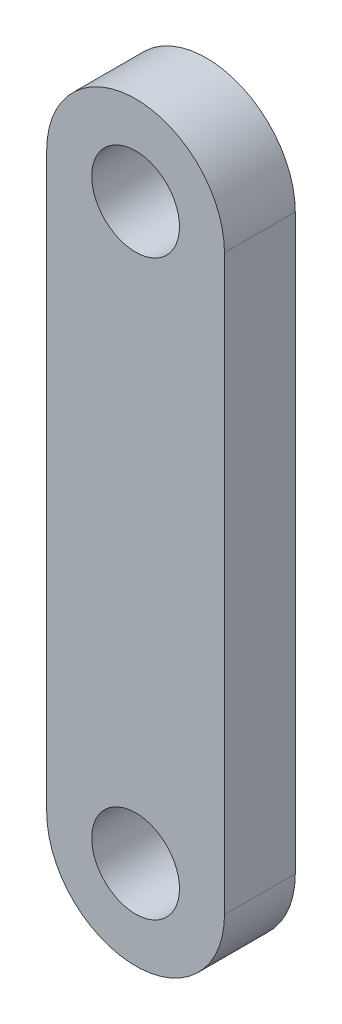
ISO-10303-21;
HEADER;
FILE_DESCRIPTION(('STEP AP214'),'2;1');
FILE_NAME('part.step','',(''),(''),'','','');
FILE_SCHEMA(('AUTOMOTIVE_DESIGN { 1 0 10303 214 1 1 1 1 }'));
ENDSEC;
DATA;
#1=APPLICATION_CONTEXT('core data for automotive mechanical design processes');
#2=APPLICATION_PROTOCOL_DEFINITION('international standard','automotive_design',2000,#1);
#3=PRODUCT_CONTEXT('',#1,'mechanical');
#4=PRODUCT('Part','Part','',(#3));
#5=PRODUCT_RELATED_PRODUCT_CATEGORY('part','',(#4));
#6=PRODUCT_DEFINITION_FORMATION('','',#4);
#7=PRODUCT_DEFINITION_CONTEXT('part definition',#1,'design');
#8=PRODUCT_DEFINITION('design','',#6,#7);
#9=PRODUCT_DEFINITION_SHAPE('','',#8);
#10=(LENGTH_UNIT() NAMED_UNIT(*) SI_UNIT(.MILLI.,.METRE.));
#11=(NAMED_UNIT(*) PLANE_ANGLE_UNIT() SI_UNIT($,.RADIAN.));
#12=(NAMED_UNIT(*) SI_UNIT($,.STERADIAN.) SOLID_ANGLE_UNIT());
#13=UNCERTAINTY_MEASURE_WITH_UNIT(LENGTH_MEASURE(1.E-05),#10,'distance_accuracy_value','');
#14=(GEOMETRIC_REPRESENTATION_CONTEXT(3) GLOBAL_UNCERTAINTY_ASSIGNED_CONTEXT((#13)) GLOBAL_UNIT_ASSIGNED_CONTEXT((#10,
#11,#12)) REPRESENTATION_CONTEXT('',''));
#15=CARTESIAN_POINT('',(0.,0.,0.));
#16=DIRECTION('',(0.,0.,1.));
#17=DIRECTION('',(1.,0.,0.));
#18=AXIS2_PLACEMENT_3D('',#15,#16,#17);
#19=CARTESIAN_POINT('',(0.,38.0750020317063,6.35));
#20=DIRECTION('',(0.,0.,1.));
#21=DIRECTION('',(1.,0.,0.));
#22=AXIS2_PLACEMENT_3D('',#19,#20,#21);
#23=PLANE('',#22);
#24=CARTESIAN_POINT('',(0.,38.0750020317063,6.35));
#25=DIRECTION('',(0.,0.,1.));
#26=DIRECTION('',(1.,0.,0.));
#27=AXIS2_PLACEMENT_3D('',#24,#25,#26);
#28=CIRCLE('',#27,3.937);
#29=CARTESIAN_POINT('',(3.937,38.0750020317063,6.35));
#30=VERTEX_POINT('',#29);
#31=EDGE_CURVE('E99',#30,#30,#28,.T.);
#32=ORIENTED_EDGE('',*,*,#31,.F.);
#33=EDGE_LOOP('',(#32));
#34=FACE_BOUND('',#33,.T.);
#35=CARTESIAN_POINT('',(0.,38.0750020317063,6.35));
#36=DIRECTION('',(0.,0.,1.));
#37=DIRECTION('',(1.,0.,0.));
#38=AXIS2_PLACEMENT_3D('',#35,#36,#37);
#39=CIRCLE('',#38,7.9756);
#40=CARTESIAN_POINT('',(7.9756,38.0750020317063,6.35));
#41=VERTEX_POINT('',#40);
#42=CARTESIAN_POINT('',(-7.9756,38.0750020317063,6.35));
#43=VERTEX_POINT('',#42);
#44=EDGE_CURVE('E84',#41,#43,#39,.T.);
#45=ORIENTED_EDGE('',*,*,#44,.T.);
#46=DIRECTION('',(0.,-1.,0.));
#47=VECTOR('',#46,1.);
#48=CARTESIAN_POINT('',(-7.9756,38.0750020317063,6.35));
#49=LINE('',#48,#47);
#50=CARTESIAN_POINT('',(-7.9756,-13.3599979682937,6.35));
#51=VERTEX_POINT('',#50);
#52=EDGE_CURVE('E79',#43,#51,#49,.T.);
#53=ORIENTED_EDGE('',*,*,#52,.T.);
#54=CARTESIAN_POINT('',(0.,-13.3599979682937,6.35));
#55=DIRECTION('',(0.,0.,1.));
#56=DIRECTION('',(1.,0.,0.));
#57=AXIS2_PLACEMENT_3D('',#54,#55,#56);
#58=CIRCLE('',#57,7.9756);
#59=CARTESIAN_POINT('',(7.97560000000001,-13.3599979682937,6.35));
#60=VERTEX_POINT('',#59);
#61=EDGE_CURVE('E82',#51,#60,#58,.T.);
#62=ORIENTED_EDGE('',*,*,#61,.T.);
#63=DIRECTION('',(0.,1.,0.));
#64=VECTOR('',#63,1.);
#65=CARTESIAN_POINT('',(7.9756,38.0750020317063,6.35));
#66=LINE('',#65,#64);
#67=EDGE_CURVE('E49',#60,#41,#66,.T.);
#68=ORIENTED_EDGE('',*,*,#67,.T.);
#69=EDGE_LOOP('',(#45,#53,#62,#68));
#70=FACE_BOUND('',#69,.T.);
#71=CARTESIAN_POINT('',(0.,-13.3599979682937,6.35));
#72=DIRECTION('',(0.,0.,1.));
#73=DIRECTION('',(1.,0.,0.));
#74=AXIS2_PLACEMENT_3D('',#71,#72,#73);
#75=CIRCLE('',#74,3.937);
#76=CARTESIAN_POINT('',(3.937,-13.3599979682937,6.35));
#77=VERTEX_POINT('',#76);
#78=EDGE_CURVE('E114',#77,#77,#75,.T.);
#79=ORIENTED_EDGE('',*,*,#78,.F.);
#80=EDGE_LOOP('',(#79));
#81=FACE_BOUND('',#80,.T.);
#82=ADVANCED_FACE('F32',(#34,#70,#81),#23,.T.);
#83=CARTESIAN_POINT('',(0.,38.0750020317063,0.));
#84=DIRECTION('',(0.,0.,1.));
#85=DIRECTION('',(1.,0.,0.));
#86=AXIS2_PLACEMENT_3D('',#83,#84,#85);
#87=PLANE('',#86);
#88=CARTESIAN_POINT('',(0.,38.0750020317063,0.));
#89=DIRECTION('',(0.,0.,1.));
#90=DIRECTION('',(1.,0.,0.));
#91=AXIS2_PLACEMENT_3D('',#88,#89,#90);
#92=CIRCLE('',#91,7.9756);
#93=CARTESIAN_POINT('',(7.9756,38.0750020317063,0.));
#94=VERTEX_POINT('',#93);
#95=CARTESIAN_POINT('',(-7.9756,38.0750020317063,0.));
#96=VERTEX_POINT('',#95);
#97=EDGE_CURVE('E96',#94,#96,#92,.T.);
#98=ORIENTED_EDGE('',*,*,#97,.F.);
#99=DIRECTION('',(0.,1.,0.));
#100=VECTOR('',#99,1.);
#101=CARTESIAN_POINT('',(7.9756,38.0750020317063,0.));
#102=LINE('',#101,#100);
#103=CARTESIAN_POINT('',(7.97560000000001,-13.3599979682937,0.));
#104=VERTEX_POINT('',#103);
#105=EDGE_CURVE('E72',#104,#94,#102,.T.);
#106=ORIENTED_EDGE('',*,*,#105,.F.);
#107=CARTESIAN_POINT('',(0.,-13.3599979682937,0.));
#108=DIRECTION('',(0.,0.,1.));
#109=DIRECTION('',(1.,0.,0.));
#110=AXIS2_PLACEMENT_3D('',#107,#108,#109);
#111=CIRCLE('',#110,7.9756);
#112=CARTESIAN_POINT('',(-7.9756,-13.3599979682937,0.));
#113=VERTEX_POINT('',#112);
#114=EDGE_CURVE('E66',#113,#104,#111,.T.);
#115=ORIENTED_EDGE('',*,*,#114,.F.);
#116=DIRECTION('',(0.,-1.,0.));
#117=VECTOR('',#116,1.);
#118=CARTESIAN_POINT('',(-7.9756,38.0750020317063,0.));
#119=LINE('',#118,#117);
#120=EDGE_CURVE('E88',#96,#113,#119,.T.);
#121=ORIENTED_EDGE('',*,*,#120,.F.);
#122=EDGE_LOOP('',(#98,#106,#115,#121));
#123=FACE_BOUND('',#122,.T.);
#124=CARTESIAN_POINT('',(0.,38.0750020317063,0.));
#125=DIRECTION('',(0.,0.,1.));
#126=DIRECTION('',(1.,0.,0.));
#127=AXIS2_PLACEMENT_3D('',#124,#125,#126);
#128=CIRCLE('',#127,3.937);
#129=CARTESIAN_POINT('',(3.937,38.0750020317063,0.));
#130=VERTEX_POINT('',#129);
#131=EDGE_CURVE('E111',#130,#130,#128,.T.);
#132=ORIENTED_EDGE('',*,*,#131,.T.);
#133=EDGE_LOOP('',(#132));
#134=FACE_BOUND('',#133,.T.);
#135=CARTESIAN_POINT('',(0.,-13.3599979682937,0.));
#136=DIRECTION('',(0.,0.,1.));
#137=DIRECTION('',(1.,0.,0.));
#138=AXIS2_PLACEMENT_3D('',#135,#136,#137);
#139=CIRCLE('',#138,3.937);
#140=CARTESIAN_POINT('',(3.937,-13.3599979682937,0.));
#141=VERTEX_POINT('',#140);
#142=EDGE_CURVE('E117',#141,#141,#139,.T.);
#143=ORIENTED_EDGE('',*,*,#142,.T.);
#144=EDGE_LOOP('',(#143));
#145=FACE_BOUND('',#144,.T.);
#146=ADVANCED_FACE('F107',(#123,#134,#145),#87,.F.);
#147=CARTESIAN_POINT('',(0.,38.0750020317063,6.35));
#148=DIRECTION('',(0.,0.,-1.));
#149=DIRECTION('',(-1.,0.,0.));
#150=AXIS2_PLACEMENT_3D('',#147,#148,#149);
#151=CYLINDRICAL_SURFACE('',#150,7.9756);
#152=ORIENTED_EDGE('',*,*,#97,.T.);
#153=DIRECTION('',(0.,0.,-1.));
#154=VECTOR('',#153,1.);
#155=CARTESIAN_POINT('',(-7.9756,38.0750020317063,6.35));
#156=LINE('',#155,#154);
#157=EDGE_CURVE('E11',#43,#96,#156,.T.);
#158=ORIENTED_EDGE('',*,*,#157,.F.);
#159=ORIENTED_EDGE('',*,*,#44,.F.);
#160=DIRECTION('',(0.,0.,-1.));
#161=VECTOR('',#160,1.);
#162=CARTESIAN_POINT('',(7.9756,38.0750020317063,6.35));
#163=LINE('',#162,#161);
#164=EDGE_CURVE('E92',#41,#94,#163,.T.);
#165=ORIENTED_EDGE('',*,*,#164,.T.);
#166=EDGE_LOOP('',(#152,#158,#159,#165));
#167=FACE_BOUND('',#166,.T.);
#168=ADVANCED_FACE('F34',(#167),#151,.T.);
#169=CARTESIAN_POINT('',(-7.9756,38.0750020317063,6.35));
#170=DIRECTION('',(1.,0.,0.));
#171=DIRECTION('',(0.,1.,0.));
#172=AXIS2_PLACEMENT_3D('',#169,#170,#171);
#173=PLANE('',#172);
#174=ORIENTED_EDGE('',*,*,#120,.T.);
#175=DIRECTION('',(0.,0.,-1.));
#176=VECTOR('',#175,1.);
#177=CARTESIAN_POINT('',(-7.9756,-13.3599979682937,6.35));
#178=LINE('',#177,#176);
#179=EDGE_CURVE('E41',#51,#113,#178,.T.);
#180=ORIENTED_EDGE('',*,*,#179,.F.);
#181=ORIENTED_EDGE('',*,*,#52,.F.);
#182=ORIENTED_EDGE('',*,*,#157,.T.);
#183=EDGE_LOOP('',(#174,#180,#181,#182));
#184=FACE_BOUND('',#183,.T.);
#185=ADVANCED_FACE('F87',(#184),#173,.F.);
#186=CARTESIAN_POINT('',(0.,-13.3599979682937,6.35));
#187=DIRECTION('',(0.,0.,-1.));
#188=DIRECTION('',(-1.,0.,0.));
#189=AXIS2_PLACEMENT_3D('',#186,#187,#188);
#190=CYLINDRICAL_SURFACE('',#189,7.9756);
#191=ORIENTED_EDGE('',*,*,#114,.T.);
#192=DIRECTION('',(0.,0.,-1.));
#193=VECTOR('',#192,1.);
#194=CARTESIAN_POINT('',(7.97560000000001,-13.3599979682937,6.35));
#195=LINE('',#194,#193);
#196=EDGE_CURVE('E89',#60,#104,#195,.T.);
#197=ORIENTED_EDGE('',*,*,#196,.F.);
#198=ORIENTED_EDGE('',*,*,#61,.F.);
#199=ORIENTED_EDGE('',*,*,#179,.T.);
#200=EDGE_LOOP('',(#191,#197,#198,#199));
#201=FACE_BOUND('',#200,.T.);
#202=ADVANCED_FACE('F90',(#201),#190,.T.);
#203=CARTESIAN_POINT('',(7.9756,38.0750020317063,6.35));
#204=DIRECTION('',(-1.,0.,0.));
#205=DIRECTION('',(0.,-1.,0.));
#206=AXIS2_PLACEMENT_3D('',#203,#204,#205);
#207=PLANE('',#206);
#208=ORIENTED_EDGE('',*,*,#105,.T.);
#209=ORIENTED_EDGE('',*,*,#164,.F.);
#210=ORIENTED_EDGE('',*,*,#67,.F.);
#211=ORIENTED_EDGE('',*,*,#196,.T.);
#212=EDGE_LOOP('',(#208,#209,#210,#211));
#213=FACE_BOUND('',#212,.T.);
#214=ADVANCED_FACE('F104',(#213),#207,.F.);
#215=CARTESIAN_POINT('',(0.,38.0750020317063,6.35));
#216=DIRECTION('',(0.,0.,-1.));
#217=DIRECTION('',(-1.,0.,0.));
#218=AXIS2_PLACEMENT_3D('',#215,#216,#217);
#219=CYLINDRICAL_SURFACE('',#218,3.937);
#220=ORIENTED_EDGE('',*,*,#31,.T.);
#221=EDGE_LOOP('',(#220));
#222=FACE_BOUND('',#221,.T.);
#223=ORIENTED_EDGE('',*,*,#131,.F.);
#224=EDGE_LOOP('',(#223));
#225=FACE_BOUND('',#224,.T.);
#226=ADVANCED_FACE('F134',(#222,#225),#219,.F.);
#227=CARTESIAN_POINT('',(0.,-13.3599979682937,6.35));
#228=DIRECTION('',(0.,0.,-1.));
#229=DIRECTION('',(-1.,0.,0.));
#230=AXIS2_PLACEMENT_3D('',#227,#228,#229);
#231=CYLINDRICAL_SURFACE('',#230,3.937);
#232=ORIENTED_EDGE('',*,*,#78,.T.);
#233=EDGE_LOOP('',(#232));
#234=FACE_BOUND('',#233,.T.);
#235=ORIENTED_EDGE('',*,*,#142,.F.);
#236=EDGE_LOOP('',(#235));
#237=FACE_BOUND('',#236,.T.);
#238=ADVANCED_FACE('F123',(#234,#237),#231,.F.);
#239=CLOSED_SHELL('',(#82,#146,#168,#185,#202,#214,#226,#238));
#240=MANIFOLD_SOLID_BREP('B2',#239);
#241=ADVANCED_BREP_SHAPE_REPRESENTATION('',(#18,#240),#14);
#242=SHAPE_DEFINITION_REPRESENTATION(#9,#241);
ENDSEC;
END-ISO-10303-21;
